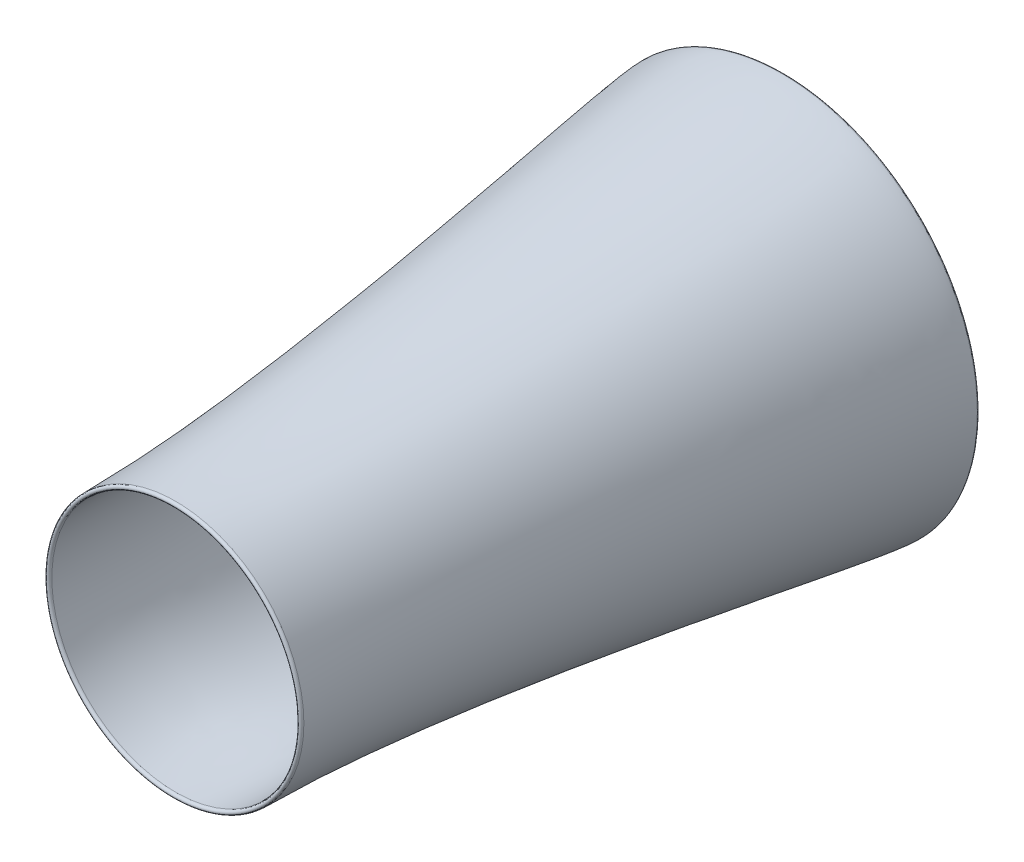
ISO-10303-21;
HEADER;
FILE_DESCRIPTION(('STEP AP214'),'2;1');
FILE_NAME('part.step','',(''),(''),'','','');
FILE_SCHEMA(('AUTOMOTIVE_DESIGN { 1 0 10303 214 1 1 1 1 }'));
ENDSEC;
DATA;
#1=APPLICATION_CONTEXT('core data for automotive mechanical design processes');
#2=APPLICATION_PROTOCOL_DEFINITION('international standard','automotive_design',2000,#1);
#3=PRODUCT_CONTEXT('',#1,'mechanical');
#4=PRODUCT('Part','Part','',(#3));
#5=PRODUCT_RELATED_PRODUCT_CATEGORY('part','',(#4));
#6=PRODUCT_DEFINITION_FORMATION('','',#4);
#7=PRODUCT_DEFINITION_CONTEXT('part definition',#1,'design');
#8=PRODUCT_DEFINITION('design','',#6,#7);
#9=PRODUCT_DEFINITION_SHAPE('','',#8);
#10=(LENGTH_UNIT() NAMED_UNIT(*) SI_UNIT(.MILLI.,.METRE.));
#11=(NAMED_UNIT(*) PLANE_ANGLE_UNIT() SI_UNIT($,.RADIAN.));
#12=(NAMED_UNIT(*) SI_UNIT($,.STERADIAN.) SOLID_ANGLE_UNIT());
#13=UNCERTAINTY_MEASURE_WITH_UNIT(LENGTH_MEASURE(1.E-05),#10,'distance_accuracy_value','');
#14=(GEOMETRIC_REPRESENTATION_CONTEXT(3) GLOBAL_UNCERTAINTY_ASSIGNED_CONTEXT((#13)) GLOBAL_UNIT_ASSIGNED_CONTEXT((#10,
#11,#12)) REPRESENTATION_CONTEXT('',''));
#15=CARTESIAN_POINT('',(0.,0.,0.));
#16=DIRECTION('',(0.,0.,1.));
#17=DIRECTION('',(1.,0.,0.));
#18=AXIS2_PLACEMENT_3D('',#15,#16,#17);
#19=CARTESIAN_POINT('',(-450.143329298044,0.,2147.30459887218));
#20=CARTESIAN_POINT('',(-450.143329298044,0.,2160.00459887218));
#21=CARTESIAN_POINT('',(-434.402318258378,0.,2160.00459887218));
#22=CARTESIAN_POINT('',(-434.402318258378,0.,2147.30459887218));
#23=B_SPLINE_CURVE_WITH_KNOTS('',3,(#19,#20,#21,#22),.UNSPECIFIED.,.F.,.F.,(4,4),(0.,1.),.UNSPECIFIED.);
#24=CARTESIAN_POINT('',(0.,0.,1104.75683012291));
#25=DIRECTION('',(0.,0.,1.));
#26=AXIS1_PLACEMENT('',#24,#25);
#27=SURFACE_OF_REVOLUTION('',#23,#26);
#28=CARTESIAN_POINT('',(0.,0.,2147.30459887218));
#29=DIRECTION('',(0.,0.,1.));
#30=DIRECTION('',(1.,0.,0.));
#31=AXIS2_PLACEMENT_3D('',#28,#29,#30);
#32=CIRCLE('',#31,434.402318258378);
#33=CARTESIAN_POINT('',(434.402318258378,0.,2147.30459887218));
#34=VERTEX_POINT('',#33);
#35=EDGE_CURVE('E47',#34,#34,#32,.T.);
#36=ORIENTED_EDGE('',*,*,#35,.F.);
#37=EDGE_LOOP('',(#36));
#38=FACE_BOUND('',#37,.T.);
#39=CARTESIAN_POINT('',(0.,0.,2147.30459887218));
#40=DIRECTION('',(0.,0.,1.));
#41=DIRECTION('',(1.,0.,0.));
#42=AXIS2_PLACEMENT_3D('',#39,#40,#41);
#43=CIRCLE('',#42,450.143329298044);
#44=CARTESIAN_POINT('',(450.143329298044,0.,2147.30459887218));
#45=VERTEX_POINT('',#44);
#46=EDGE_CURVE('E11',#45,#45,#43,.T.);
#47=ORIENTED_EDGE('',*,*,#46,.T.);
#48=EDGE_LOOP('',(#47));
#49=FACE_BOUND('',#48,.T.);
#50=ADVANCED_FACE('F40',(#38,#49),#27,.T.);
#51=CARTESIAN_POINT('',(-450.143329298044,0.,2147.30459887218));
#52=DIRECTION('',(0.,0.,1.));
#53=DIRECTION('',(1.,0.,0.));
#54=AXIS2_PLACEMENT_3D('',#51,#52,#53);
#55=PLANE('',#54);
#56=ORIENTED_EDGE('',*,*,#46,.F.);
#57=EDGE_LOOP('',(#56));
#58=FACE_BOUND('',#57,.T.);
#59=ORIENTED_EDGE('',*,*,#35,.T.);
#60=EDGE_LOOP('',(#59));
#61=FACE_BOUND('',#60,.T.);
#62=ADVANCED_FACE('F59',(#58,#61),#55,.F.);
#63=CLOSED_SHELL('',(#50,#62));
#64=MANIFOLD_SOLID_BREP('B2',#63);
#65=CARTESIAN_POINT('',(-603.463057220694,0.,20.0975326647073));
#66=CARTESIAN_POINT('',(-603.463057220694,0.,3.16419933137379));
#67=CARTESIAN_POINT('',(-686.282291630571,0.,3.16419933137391));
#68=CARTESIAN_POINT('',(-686.282291630571,0.,20.0975326647073));
#69=B_SPLINE_CURVE_WITH_KNOTS('',3,(#65,#66,#67,#68),.UNSPECIFIED.,.F.,.F.,(4,4),(0.,1.),.UNSPECIFIED.);
#70=CARTESIAN_POINT('',(0.,0.,99.6847843209707));
#71=DIRECTION('',(0.,0.,1.));
#72=AXIS1_PLACEMENT('',#70,#71);
#73=SURFACE_OF_REVOLUTION('',#69,#72);
#74=CARTESIAN_POINT('',(0.,0.,20.0975326647073));
#75=DIRECTION('',(0.,0.,1.));
#76=DIRECTION('',(1.,0.,0.));
#77=AXIS2_PLACEMENT_3D('',#74,#75,#76);
#78=CIRCLE('',#77,686.282291630571);
#79=CARTESIAN_POINT('',(686.282291630571,0.,20.0975326647073));
#80=VERTEX_POINT('',#79);
#81=EDGE_CURVE('E39',#80,#80,#78,.T.);
#82=ORIENTED_EDGE('',*,*,#81,.F.);
#83=EDGE_LOOP('',(#82));
#84=FACE_BOUND('',#83,.T.);
#85=CARTESIAN_POINT('',(0.,0.,20.0975326647073));
#86=DIRECTION('',(0.,0.,1.));
#87=DIRECTION('',(1.,0.,0.));
#88=AXIS2_PLACEMENT_3D('',#85,#86,#87);
#89=CIRCLE('',#88,603.463057220693);
#90=CARTESIAN_POINT('',(603.463057220693,0.,20.0975326647073));
#91=VERTEX_POINT('',#90);
#92=EDGE_CURVE('E93',#91,#91,#89,.T.);
#93=ORIENTED_EDGE('',*,*,#92,.T.);
#94=EDGE_LOOP('',(#93));
#95=FACE_BOUND('',#94,.T.);
#96=ADVANCED_FACE('F86',(#84,#95),#73,.T.);
#97=CARTESIAN_POINT('',(-686.282291630571,0.,20.0975326647073));
#98=DIRECTION('',(0.,0.,-1.));
#99=DIRECTION('',(-1.,0.,0.));
#100=AXIS2_PLACEMENT_3D('',#97,#98,#99);
#101=PLANE('',#100);
#102=ORIENTED_EDGE('',*,*,#92,.F.);
#103=EDGE_LOOP('',(#102));
#104=FACE_BOUND('',#103,.T.);
#105=ORIENTED_EDGE('',*,*,#81,.T.);
#106=EDGE_LOOP('',(#105));
#107=FACE_BOUND('',#106,.T.);
#108=ADVANCED_FACE('F106',(#104,#107),#101,.F.);
#109=CLOSED_SHELL('',(#96,#108));
#110=MANIFOLD_SOLID_BREP('B6',#109);
#111=CARTESIAN_POINT('',(-434.402318258378,0.,2147.30459887218));
#112=CARTESIAN_POINT('',(-434.402318258389,0.,1858.19597823229));
#113=CARTESIAN_POINT('',(-399.895973283238,0.,1827.46708518449));
#114=CARTESIAN_POINT('',(-515.75567106058,0.,762.88818320114));
#115=CARTESIAN_POINT('',(-549.077001448632,0.,603.012289082583));
#116=CARTESIAN_POINT('',(-603.463057220693,0.,72.7332851867209));
#117=CARTESIAN_POINT('',(-603.463057220693,0.,20.0975326647073));
#118=B_SPLINE_CURVE_WITH_KNOTS('',3,(#111,#112,#113,#114,#115,#116,#117),.UNSPECIFIED.,.F.,.F.,
(4,1,1,1,4),(0.,0.515022649097204,0.793493092504956,0.841990827595236,1.),.UNSPECIFIED.);
#119=CARTESIAN_POINT('',(0.,0.,99.6847843209707));
#120=DIRECTION('',(0.,0.,1.));
#121=AXIS1_PLACEMENT('',#119,#120);
#122=SURFACE_OF_REVOLUTION('',#118,#121);
#123=CARTESIAN_POINT('',(0.,0.,20.0975326647073));
#124=DIRECTION('',(0.,0.,1.));
#125=DIRECTION('',(1.,0.,0.));
#126=AXIS2_PLACEMENT_3D('',#123,#124,#125);
#127=CIRCLE('',#126,603.463057220693);
#128=CARTESIAN_POINT('',(603.463057220693,0.,20.0975326647073));
#129=VERTEX_POINT('',#128);
#130=EDGE_CURVE('E140',#129,#129,#127,.T.);
#131=ORIENTED_EDGE('',*,*,#130,.F.);
#132=EDGE_LOOP('',(#131));
#133=FACE_BOUND('',#132,.T.);
#134=CARTESIAN_POINT('',(0.,0.,2147.30459887218));
#135=DIRECTION('',(0.,0.,1.));
#136=DIRECTION('',(1.,0.,0.));
#137=AXIS2_PLACEMENT_3D('',#134,#135,#136);
#138=CIRCLE('',#137,434.402318258378);
#139=CARTESIAN_POINT('',(434.402318258378,0.,2147.30459887218));
#140=VERTEX_POINT('',#139);
#141=EDGE_CURVE('E85',#140,#140,#138,.T.);
#142=ORIENTED_EDGE('',*,*,#141,.T.);
#143=EDGE_LOOP('',(#142));
#144=FACE_BOUND('',#143,.T.);
#145=ADVANCED_FACE('F125',(#133,#144),#122,.T.);
#146=CARTESIAN_POINT('',(-434.402318258378,0.,2147.30459887218));
#147=DIRECTION('',(0.,0.,-1.));
#148=DIRECTION('',(-1.,0.,0.));
#149=AXIS2_PLACEMENT_3D('',#146,#147,#148);
#150=PLANE('',#149);
#151=ORIENTED_EDGE('',*,*,#141,.F.);
#152=EDGE_LOOP('',(#151));
#153=FACE_BOUND('',#152,.T.);
#154=CARTESIAN_POINT('',(0.,0.,2147.30459887218));
#155=DIRECTION('',(0.,0.,1.));
#156=DIRECTION('',(1.,0.,0.));
#157=AXIS2_PLACEMENT_3D('',#154,#155,#156);
#158=CIRCLE('',#157,450.143329298044);
#159=CARTESIAN_POINT('',(450.143329298044,0.,2147.30459887218));
#160=VERTEX_POINT('',#159);
#161=EDGE_CURVE('E132',#160,#160,#158,.T.);
#162=ORIENTED_EDGE('',*,*,#161,.T.);
#163=EDGE_LOOP('',(#162));
#164=FACE_BOUND('',#163,.T.);
#165=ADVANCED_FACE('F159',(#153,#164),#150,.F.);
#166=CARTESIAN_POINT('',(-686.282291630571,0.,20.0975326647073));
#167=CARTESIAN_POINT('',(-686.282291630571,0.,145.481485041));
#168=CARTESIAN_POINT('',(-450.143329298043,0.,1416.99547848696));
#169=CARTESIAN_POINT('',(-450.143329298044,0.,2147.30459887218));
#170=B_SPLINE_CURVE_WITH_KNOTS('',3,(#166,#167,#168,#169),.UNSPECIFIED.,.F.,.F.,(4,4),(0.,1.),.UNSPECIFIED.);
#171=CARTESIAN_POINT('',(0.,0.,99.6847843209707));
#172=DIRECTION('',(0.,0.,1.));
#173=AXIS1_PLACEMENT('',#171,#172);
#174=SURFACE_OF_REVOLUTION('',#170,#173);
#175=ORIENTED_EDGE('',*,*,#161,.F.);
#176=EDGE_LOOP('',(#175));
#177=FACE_BOUND('',#176,.T.);
#178=CARTESIAN_POINT('',(0.,0.,20.0975326647073));
#179=DIRECTION('',(0.,0.,1.));
#180=DIRECTION('',(1.,0.,0.));
#181=AXIS2_PLACEMENT_3D('',#178,#179,#180);
#182=CIRCLE('',#181,686.282291630571);
#183=CARTESIAN_POINT('',(686.282291630571,0.,20.0975326647073));
#184=VERTEX_POINT('',#183);
#185=EDGE_CURVE('E136',#184,#184,#182,.T.);
#186=ORIENTED_EDGE('',*,*,#185,.T.);
#187=EDGE_LOOP('',(#186));
#188=FACE_BOUND('',#187,.T.);
#189=ADVANCED_FACE('F155',(#177,#188),#174,.T.);
#190=CARTESIAN_POINT('',(-603.463057220693,0.,20.0975326647073));
#191=DIRECTION('',(0.,0.,1.));
#192=DIRECTION('',(1.,0.,0.));
#193=AXIS2_PLACEMENT_3D('',#190,#191,#192);
#194=PLANE('',#193);
#195=ORIENTED_EDGE('',*,*,#185,.F.);
#196=EDGE_LOOP('',(#195));
#197=FACE_BOUND('',#196,.T.);
#198=ORIENTED_EDGE('',*,*,#130,.T.);
#199=EDGE_LOOP('',(#198));
#200=FACE_BOUND('',#199,.T.);
#201=ADVANCED_FACE('F158',(#197,#200),#194,.F.);
#202=CLOSED_SHELL('',(#145,#165,#189,#201));
#203=MANIFOLD_SOLID_BREP('B34',#202);
#204=ADVANCED_BREP_SHAPE_REPRESENTATION('',(#18,#64,#110,#203),#14);
#205=SHAPE_DEFINITION_REPRESENTATION(#9,#204);
ENDSEC;
END-ISO-10303-21;
